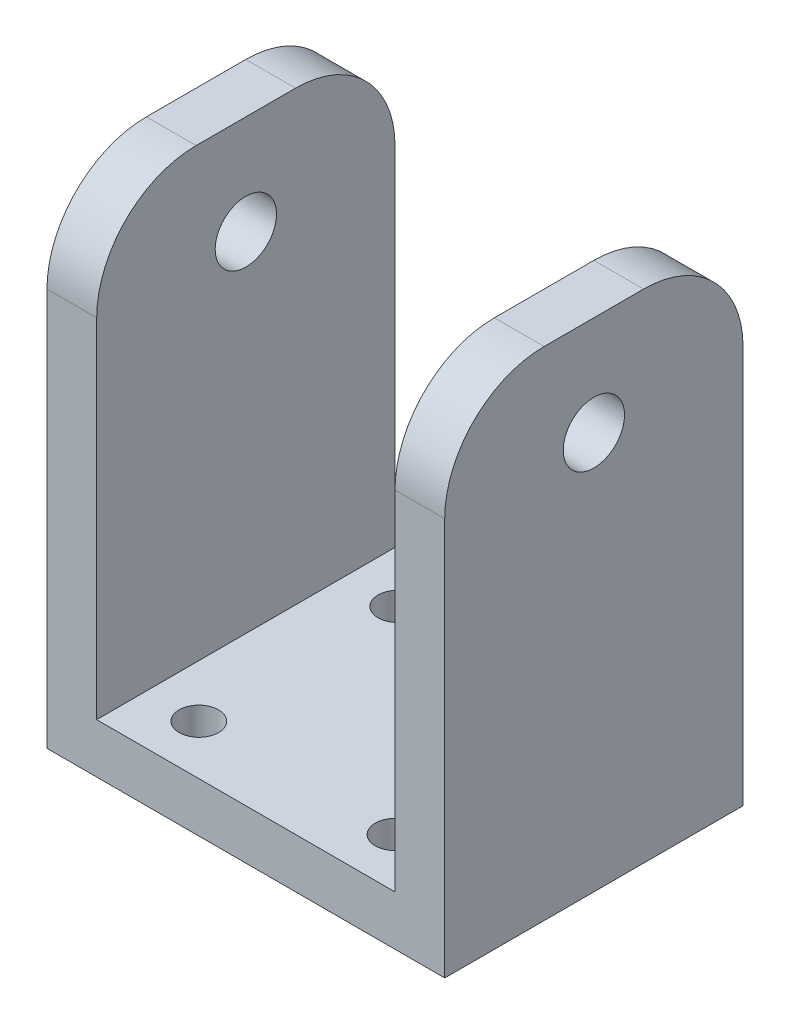
ISO-10303-21;
HEADER;
FILE_DESCRIPTION(('STEP AP214'),'2;1');
FILE_NAME('part.step','',(''),(''),'','','');
FILE_SCHEMA(('AUTOMOTIVE_DESIGN { 1 0 10303 214 1 1 1 1 }'));
ENDSEC;
DATA;
#1=APPLICATION_CONTEXT('core data for automotive mechanical design processes');
#2=APPLICATION_PROTOCOL_DEFINITION('international standard','automotive_design',2000,#1);
#3=PRODUCT_CONTEXT('',#1,'mechanical');
#4=PRODUCT('Part','Part','',(#3));
#5=PRODUCT_RELATED_PRODUCT_CATEGORY('part','',(#4));
#6=PRODUCT_DEFINITION_FORMATION('','',#4);
#7=PRODUCT_DEFINITION_CONTEXT('part definition',#1,'design');
#8=PRODUCT_DEFINITION('design','',#6,#7);
#9=PRODUCT_DEFINITION_SHAPE('','',#8);
#10=(LENGTH_UNIT() NAMED_UNIT(*) SI_UNIT(.MILLI.,.METRE.));
#11=(NAMED_UNIT(*) PLANE_ANGLE_UNIT() SI_UNIT($,.RADIAN.));
#12=(NAMED_UNIT(*) SI_UNIT($,.STERADIAN.) SOLID_ANGLE_UNIT());
#13=UNCERTAINTY_MEASURE_WITH_UNIT(LENGTH_MEASURE(1.E-05),#10,'distance_accuracy_value','');
#14=(GEOMETRIC_REPRESENTATION_CONTEXT(3) GLOBAL_UNCERTAINTY_ASSIGNED_CONTEXT((#13)) GLOBAL_UNIT_ASSIGNED_CONTEXT((#10,
#11,#12)) REPRESENTATION_CONTEXT('',''));
#15=CARTESIAN_POINT('',(0.,0.,0.));
#16=DIRECTION('',(0.,0.,1.));
#17=DIRECTION('',(1.,0.,0.));
#18=AXIS2_PLACEMENT_3D('',#15,#16,#17);
#19=CARTESIAN_POINT('',(0.,50.,0.));
#20=DIRECTION('',(0.,-1.,0.));
#21=DIRECTION('',(0.,0.,-1.));
#22=AXIS2_PLACEMENT_3D('',#19,#20,#21);
#23=PLANE('',#22);
#24=DIRECTION('',(0.,0.,1.));
#25=VECTOR('',#24,1.);
#26=CARTESIAN_POINT('',(5.,50.,-30.));
#27=LINE('',#26,#25);
#28=CARTESIAN_POINT('',(5.,50.,-20.));
#29=VERTEX_POINT('',#28);
#30=CARTESIAN_POINT('',(5.,50.,-10.));
#31=VERTEX_POINT('',#30);
#32=EDGE_CURVE('E159',#29,#31,#27,.T.);
#33=ORIENTED_EDGE('',*,*,#32,.F.);
#34=DIRECTION('',(-1.,0.,0.));
#35=VECTOR('',#34,1.);
#36=CARTESIAN_POINT('',(0.,50.,-20.));
#37=LINE('',#36,#35);
#38=CARTESIAN_POINT('',(0.,50.,-20.));
#39=VERTEX_POINT('',#38);
#40=EDGE_CURVE('E195',#29,#39,#37,.T.);
#41=ORIENTED_EDGE('',*,*,#40,.T.);
#42=DIRECTION('',(0.,0.,1.));
#43=VECTOR('',#42,1.);
#44=CARTESIAN_POINT('',(0.,50.,0.));
#45=LINE('',#44,#43);
#46=CARTESIAN_POINT('',(0.,50.,-10.));
#47=VERTEX_POINT('',#46);
#48=EDGE_CURVE('E167',#39,#47,#45,.T.);
#49=ORIENTED_EDGE('',*,*,#48,.T.);
#50=DIRECTION('',(1.,0.,0.));
#51=VECTOR('',#50,1.);
#52=CARTESIAN_POINT('',(0.,50.,-10.));
#53=LINE('',#52,#51);
#54=EDGE_CURVE('E192',#47,#31,#53,.T.);
#55=ORIENTED_EDGE('',*,*,#54,.T.);
#56=EDGE_LOOP('',(#33,#41,#49,#55));
#57=FACE_BOUND('',#56,.T.);
#58=ADVANCED_FACE('F35',(#57),#23,.F.);
#59=CARTESIAN_POINT('',(0.,50.,0.));
#60=DIRECTION('',(1.,0.,0.));
#61=DIRECTION('',(0.,0.,-1.));
#62=AXIS2_PLACEMENT_3D('',#59,#60,#61);
#63=PLANE('',#62);
#64=CARTESIAN_POINT('',(0.,40.,-15.));
#65=DIRECTION('',(1.,0.,0.));
#66=DIRECTION('',(0.,0.,-1.));
#67=AXIS2_PLACEMENT_3D('',#64,#65,#66);
#68=CIRCLE('',#67,3.08310492579836);
#69=CARTESIAN_POINT('',(0.,40.,-18.0831049257984));
#70=VERTEX_POINT('',#69);
#71=EDGE_CURVE('E309',#70,#70,#68,.T.);
#72=ORIENTED_EDGE('',*,*,#71,.T.);
#73=EDGE_LOOP('',(#72));
#74=FACE_BOUND('',#73,.T.);
#75=ORIENTED_EDGE('',*,*,#48,.F.);
#76=CARTESIAN_POINT('',(0.,40.,-20.));
#77=DIRECTION('',(1.,0.,0.));
#78=DIRECTION('',(0.,0.,-1.));
#79=AXIS2_PLACEMENT_3D('',#76,#77,#78);
#80=CIRCLE('',#79,10.);
#81=CARTESIAN_POINT('',(0.,40.,-30.));
#82=VERTEX_POINT('',#81);
#83=EDGE_CURVE('E200',#39,#82,#80,.F.);
#84=ORIENTED_EDGE('',*,*,#83,.T.);
#85=DIRECTION('',(0.,-1.,0.));
#86=VECTOR('',#85,1.);
#87=CARTESIAN_POINT('',(0.,50.,-30.));
#88=LINE('',#87,#86);
#89=CARTESIAN_POINT('',(0.,0.,-30.));
#90=VERTEX_POINT('',#89);
#91=EDGE_CURVE('E174',#82,#90,#88,.T.);
#92=ORIENTED_EDGE('',*,*,#91,.T.);
#93=DIRECTION('',(0.,0.,1.));
#94=VECTOR('',#93,1.);
#95=CARTESIAN_POINT('',(0.,0.,0.));
#96=LINE('',#95,#94);
#97=CARTESIAN_POINT('',(0.,0.,0.));
#98=VERTEX_POINT('',#97);
#99=EDGE_CURVE('E162',#90,#98,#96,.T.);
#100=ORIENTED_EDGE('',*,*,#99,.T.);
#101=DIRECTION('',(0.,-1.,0.));
#102=VECTOR('',#101,1.);
#103=CARTESIAN_POINT('',(0.,50.,0.));
#104=LINE('',#103,#102);
#105=CARTESIAN_POINT('',(0.,40.,0.));
#106=VERTEX_POINT('',#105);
#107=EDGE_CURVE('E190',#106,#98,#104,.T.);
#108=ORIENTED_EDGE('',*,*,#107,.F.);
#109=CARTESIAN_POINT('',(0.,40.,-10.));
#110=DIRECTION('',(1.,0.,0.));
#111=DIRECTION('',(0.,0.,-1.));
#112=AXIS2_PLACEMENT_3D('',#109,#110,#111);
#113=CIRCLE('',#112,10.);
#114=EDGE_CURVE('E198',#106,#47,#113,.F.);
#115=ORIENTED_EDGE('',*,*,#114,.T.);
#116=EDGE_LOOP('',(#75,#84,#92,#100,#108,#115));
#117=FACE_BOUND('',#116,.T.);
#118=ADVANCED_FACE('F230',(#74,#117),#63,.F.);
#119=CARTESIAN_POINT('',(0.,50.,0.));
#120=DIRECTION('',(0.,0.,-1.));
#121=DIRECTION('',(-1.,0.,0.));
#122=AXIS2_PLACEMENT_3D('',#119,#120,#121);
#123=PLANE('',#122);
#124=DIRECTION('',(0.,-1.,0.));
#125=VECTOR('',#124,1.);
#126=CARTESIAN_POINT('',(40.,50.,0.));
#127=LINE('',#126,#125);
#128=CARTESIAN_POINT('',(40.,40.,0.));
#129=VERTEX_POINT('',#128);
#130=CARTESIAN_POINT('',(40.,0.,0.));
#131=VERTEX_POINT('',#130);
#132=EDGE_CURVE('E188',#129,#131,#127,.T.);
#133=ORIENTED_EDGE('',*,*,#132,.F.);
#134=DIRECTION('',(1.,0.,0.));
#135=VECTOR('',#134,1.);
#136=CARTESIAN_POINT('',(0.,40.,0.));
#137=LINE('',#136,#135);
#138=CARTESIAN_POINT('',(35.,40.,0.));
#139=VERTEX_POINT('',#138);
#140=EDGE_CURVE('E11',#129,#139,#137,.F.);
#141=ORIENTED_EDGE('',*,*,#140,.T.);
#142=DIRECTION('',(0.,1.,0.));
#143=VECTOR('',#142,1.);
#144=CARTESIAN_POINT('',(35.,50.,0.));
#145=LINE('',#144,#143);
#146=CARTESIAN_POINT('',(35.,5.,0.));
#147=VERTEX_POINT('',#146);
#148=EDGE_CURVE('E135',#147,#139,#145,.T.);
#149=ORIENTED_EDGE('',*,*,#148,.F.);
#150=DIRECTION('',(1.,0.,0.));
#151=VECTOR('',#150,1.);
#152=CARTESIAN_POINT('',(5.,5.,0.));
#153=LINE('',#152,#151);
#154=CARTESIAN_POINT('',(5.,5.,0.));
#155=VERTEX_POINT('',#154);
#156=EDGE_CURVE('E155',#155,#147,#153,.T.);
#157=ORIENTED_EDGE('',*,*,#156,.F.);
#158=DIRECTION('',(0.,-1.,0.));
#159=VECTOR('',#158,1.);
#160=CARTESIAN_POINT('',(5.,50.,0.));
#161=LINE('',#160,#159);
#162=CARTESIAN_POINT('',(5.,40.,0.));
#163=VERTEX_POINT('',#162);
#164=EDGE_CURVE('E141',#163,#155,#161,.T.);
#165=ORIENTED_EDGE('',*,*,#164,.F.);
#166=DIRECTION('',(1.,0.,0.));
#167=VECTOR('',#166,1.);
#168=CARTESIAN_POINT('',(0.,40.,0.));
#169=LINE('',#168,#167);
#170=EDGE_CURVE('E44',#163,#106,#169,.F.);
#171=ORIENTED_EDGE('',*,*,#170,.T.);
#172=ORIENTED_EDGE('',*,*,#107,.T.);
#173=DIRECTION('',(1.,0.,0.));
#174=VECTOR('',#173,1.);
#175=CARTESIAN_POINT('',(0.,0.,0.));
#176=LINE('',#175,#174);
#177=EDGE_CURVE('E177',#98,#131,#176,.T.);
#178=ORIENTED_EDGE('',*,*,#177,.T.);
#179=EDGE_LOOP('',(#133,#141,#149,#157,#165,#171,#172,#178));
#180=FACE_BOUND('',#179,.T.);
#181=ADVANCED_FACE('F224',(#180),#123,.F.);
#182=CARTESIAN_POINT('',(40.,50.,0.));
#183=DIRECTION('',(-1.,0.,0.));
#184=DIRECTION('',(0.,0.,1.));
#185=AXIS2_PLACEMENT_3D('',#182,#183,#184);
#186=PLANE('',#185);
#187=CARTESIAN_POINT('',(40.,40.,-15.));
#188=DIRECTION('',(1.,0.,0.));
#189=DIRECTION('',(0.,0.,-1.));
#190=AXIS2_PLACEMENT_3D('',#187,#188,#189);
#191=CIRCLE('',#190,3.08310492579836);
#192=CARTESIAN_POINT('',(40.,40.,-18.0831049257984));
#193=VERTEX_POINT('',#192);
#194=EDGE_CURVE('E315',#193,#193,#191,.T.);
#195=ORIENTED_EDGE('',*,*,#194,.F.);
#196=EDGE_LOOP('',(#195));
#197=FACE_BOUND('',#196,.T.);
#198=DIRECTION('',(0.,-1.,0.));
#199=VECTOR('',#198,1.);
#200=CARTESIAN_POINT('',(40.,50.,-30.));
#201=LINE('',#200,#199);
#202=CARTESIAN_POINT('',(40.,40.,-30.));
#203=VERTEX_POINT('',#202);
#204=CARTESIAN_POINT('',(40.,0.,-30.));
#205=VERTEX_POINT('',#204);
#206=EDGE_CURVE('E186',#203,#205,#201,.T.);
#207=ORIENTED_EDGE('',*,*,#206,.F.);
#208=CARTESIAN_POINT('',(40.,40.,-20.));
#209=DIRECTION('',(-1.,0.,0.));
#210=DIRECTION('',(0.,0.,1.));
#211=AXIS2_PLACEMENT_3D('',#208,#209,#210);
#212=CIRCLE('',#211,10.);
#213=CARTESIAN_POINT('',(40.,50.,-20.));
#214=VERTEX_POINT('',#213);
#215=EDGE_CURVE('E220',#203,#214,#212,.F.);
#216=ORIENTED_EDGE('',*,*,#215,.T.);
#217=DIRECTION('',(0.,0.,-1.));
#218=VECTOR('',#217,1.);
#219=CARTESIAN_POINT('',(40.,50.,0.));
#220=LINE('',#219,#218);
#221=CARTESIAN_POINT('',(40.,50.,-10.));
#222=VERTEX_POINT('',#221);
#223=EDGE_CURVE('E170',#222,#214,#220,.T.);
#224=ORIENTED_EDGE('',*,*,#223,.F.);
#225=CARTESIAN_POINT('',(40.,40.,-10.));
#226=DIRECTION('',(-1.,0.,0.));
#227=DIRECTION('',(0.,0.,1.));
#228=AXIS2_PLACEMENT_3D('',#225,#226,#227);
#229=CIRCLE('',#228,10.);
#230=EDGE_CURVE('E51',#222,#129,#229,.F.);
#231=ORIENTED_EDGE('',*,*,#230,.T.);
#232=ORIENTED_EDGE('',*,*,#132,.T.);
#233=DIRECTION('',(0.,0.,-1.));
#234=VECTOR('',#233,1.);
#235=CARTESIAN_POINT('',(40.,0.,0.));
#236=LINE('',#235,#234);
#237=EDGE_CURVE('E180',#131,#205,#236,.T.);
#238=ORIENTED_EDGE('',*,*,#237,.T.);
#239=EDGE_LOOP('',(#207,#216,#224,#231,#232,#238));
#240=FACE_BOUND('',#239,.T.);
#241=ADVANCED_FACE('F257',(#197,#240),#186,.F.);
#242=CARTESIAN_POINT('',(0.,50.,-30.));
#243=DIRECTION('',(0.,0.,1.));
#244=DIRECTION('',(1.,0.,0.));
#245=AXIS2_PLACEMENT_3D('',#242,#243,#244);
#246=PLANE('',#245);
#247=ORIENTED_EDGE('',*,*,#91,.F.);
#248=DIRECTION('',(-1.,0.,0.));
#249=VECTOR('',#248,1.);
#250=CARTESIAN_POINT('',(0.,40.,-30.));
#251=LINE('',#250,#249);
#252=CARTESIAN_POINT('',(5.,40.,-30.));
#253=VERTEX_POINT('',#252);
#254=EDGE_CURVE('E132',#82,#253,#251,.F.);
#255=ORIENTED_EDGE('',*,*,#254,.T.);
#256=DIRECTION('',(0.,-1.,0.));
#257=VECTOR('',#256,1.);
#258=CARTESIAN_POINT('',(5.,50.,-30.));
#259=LINE('',#258,#257);
#260=CARTESIAN_POINT('',(5.,5.,-30.));
#261=VERTEX_POINT('',#260);
#262=EDGE_CURVE('E124',#253,#261,#259,.T.);
#263=ORIENTED_EDGE('',*,*,#262,.T.);
#264=DIRECTION('',(1.,0.,0.));
#265=VECTOR('',#264,1.);
#266=CARTESIAN_POINT('',(5.,5.,-30.));
#267=LINE('',#266,#265);
#268=CARTESIAN_POINT('',(35.,5.,-30.));
#269=VERTEX_POINT('',#268);
#270=EDGE_CURVE('E130',#261,#269,#267,.T.);
#271=ORIENTED_EDGE('',*,*,#270,.T.);
#272=DIRECTION('',(0.,1.,0.));
#273=VECTOR('',#272,1.);
#274=CARTESIAN_POINT('',(35.,50.,-30.));
#275=LINE('',#274,#273);
#276=CARTESIAN_POINT('',(35.,40.,-30.));
#277=VERTEX_POINT('',#276);
#278=EDGE_CURVE('E146',#269,#277,#275,.T.);
#279=ORIENTED_EDGE('',*,*,#278,.T.);
#280=DIRECTION('',(-1.,0.,0.));
#281=VECTOR('',#280,1.);
#282=CARTESIAN_POINT('',(0.,40.,-30.));
#283=LINE('',#282,#281);
#284=EDGE_CURVE('E202',#277,#203,#283,.F.);
#285=ORIENTED_EDGE('',*,*,#284,.T.);
#286=ORIENTED_EDGE('',*,*,#206,.T.);
#287=DIRECTION('',(-1.,0.,0.));
#288=VECTOR('',#287,1.);
#289=CARTESIAN_POINT('',(0.,0.,-30.));
#290=LINE('',#289,#288);
#291=EDGE_CURVE('E171',#205,#90,#290,.T.);
#292=ORIENTED_EDGE('',*,*,#291,.T.);
#293=EDGE_LOOP('',(#247,#255,#263,#271,#279,#285,#286,#292));
#294=FACE_BOUND('',#293,.T.);
#295=ADVANCED_FACE('F127',(#294),#246,.F.);
#296=ORIENTED_EDGE('',*,*,#223,.T.);
#297=DIRECTION('',(-1.,0.,0.));
#298=VECTOR('',#297,1.);
#299=CARTESIAN_POINT('',(0.,50.,-20.));
#300=LINE('',#299,#298);
#301=CARTESIAN_POINT('',(35.,50.,-20.));
#302=VERTEX_POINT('',#301);
#303=EDGE_CURVE('E212',#214,#302,#300,.T.);
#304=ORIENTED_EDGE('',*,*,#303,.T.);
#305=DIRECTION('',(0.,0.,1.));
#306=VECTOR('',#305,1.);
#307=CARTESIAN_POINT('',(35.,50.,-30.));
#308=LINE('',#307,#306);
#309=CARTESIAN_POINT('',(35.,50.,-10.));
#310=VERTEX_POINT('',#309);
#311=EDGE_CURVE('E163',#302,#310,#308,.T.);
#312=ORIENTED_EDGE('',*,*,#311,.T.);
#313=DIRECTION('',(1.,0.,0.));
#314=VECTOR('',#313,1.);
#315=CARTESIAN_POINT('',(0.,50.,-10.));
#316=LINE('',#315,#314);
#317=EDGE_CURVE('E209',#310,#222,#316,.T.);
#318=ORIENTED_EDGE('',*,*,#317,.T.);
#319=EDGE_LOOP('',(#296,#304,#312,#318));
#320=FACE_BOUND('',#319,.T.);
#321=ADVANCED_FACE('F251',(#320),#23,.F.);
#322=CARTESIAN_POINT('',(0.,0.,0.));
#323=DIRECTION('',(0.,-1.,0.));
#324=DIRECTION('',(0.,0.,-1.));
#325=AXIS2_PLACEMENT_3D('',#322,#323,#324);
#326=PLANE('',#325);
#327=CARTESIAN_POINT('',(30.,0.,-5.));
#328=DIRECTION('',(0.,-1.,0.));
#329=DIRECTION('',(0.,0.,-1.));
#330=AXIS2_PLACEMENT_3D('',#327,#328,#329);
#331=CIRCLE('',#330,1.98437499999999);
#332=CARTESIAN_POINT('',(30.,0.,-6.98437499999999));
#333=VERTEX_POINT('',#332);
#334=EDGE_CURVE('E289',#333,#333,#331,.T.);
#335=ORIENTED_EDGE('',*,*,#334,.F.);
#336=EDGE_LOOP('',(#335));
#337=FACE_BOUND('',#336,.T.);
#338=CARTESIAN_POINT('',(30.,0.,-25.));
#339=DIRECTION('',(0.,-1.,0.));
#340=DIRECTION('',(0.,0.,-1.));
#341=AXIS2_PLACEMENT_3D('',#338,#339,#340);
#342=CIRCLE('',#341,1.98437499999999);
#343=CARTESIAN_POINT('',(30.,0.,-26.984375));
#344=VERTEX_POINT('',#343);
#345=EDGE_CURVE('E293',#344,#344,#342,.T.);
#346=ORIENTED_EDGE('',*,*,#345,.F.);
#347=EDGE_LOOP('',(#346));
#348=FACE_BOUND('',#347,.T.);
#349=CARTESIAN_POINT('',(10.2728037976814,0.,-25.));
#350=DIRECTION('',(0.,-1.,0.));
#351=DIRECTION('',(0.,0.,-1.));
#352=AXIS2_PLACEMENT_3D('',#349,#350,#351);
#353=CIRCLE('',#352,1.984375);
#354=CARTESIAN_POINT('',(10.2728037976814,0.,-26.984375));
#355=VERTEX_POINT('',#354);
#356=EDGE_CURVE('E297',#355,#355,#353,.T.);
#357=ORIENTED_EDGE('',*,*,#356,.F.);
#358=EDGE_LOOP('',(#357));
#359=FACE_BOUND('',#358,.T.);
#360=CARTESIAN_POINT('',(10.2728037976814,0.,-5.));
#361=DIRECTION('',(0.,-1.,0.));
#362=DIRECTION('',(0.,0.,-1.));
#363=AXIS2_PLACEMENT_3D('',#360,#361,#362);
#364=CIRCLE('',#363,1.984375);
#365=CARTESIAN_POINT('',(10.2728037976814,0.,-6.984375));
#366=VERTEX_POINT('',#365);
#367=EDGE_CURVE('E156',#366,#366,#364,.T.);
#368=ORIENTED_EDGE('',*,*,#367,.F.);
#369=EDGE_LOOP('',(#368));
#370=FACE_BOUND('',#369,.T.);
#371=ORIENTED_EDGE('',*,*,#99,.F.);
#372=ORIENTED_EDGE('',*,*,#291,.F.);
#373=ORIENTED_EDGE('',*,*,#237,.F.);
#374=ORIENTED_EDGE('',*,*,#177,.F.);
#375=EDGE_LOOP('',(#371,#372,#373,#374));
#376=FACE_BOUND('',#375,.T.);
#377=ADVANCED_FACE('F242',(#337,#348,#359,#370,#376),#326,.T.);
#378=CARTESIAN_POINT('',(5.,50.,-30.));
#379=DIRECTION('',(-1.,0.,0.));
#380=DIRECTION('',(0.,-1.,0.));
#381=AXIS2_PLACEMENT_3D('',#378,#379,#380);
#382=PLANE('',#381);
#383=CARTESIAN_POINT('',(5.,40.,-15.));
#384=DIRECTION('',(-1.,0.,0.));
#385=DIRECTION('',(0.,-1.,0.));
#386=AXIS2_PLACEMENT_3D('',#383,#384,#385);
#387=CIRCLE('',#386,3.08310492579836);
#388=CARTESIAN_POINT('',(5.,36.9168950742016,-15.));
#389=VERTEX_POINT('',#388);
#390=EDGE_CURVE('E312',#389,#389,#387,.T.);
#391=ORIENTED_EDGE('',*,*,#390,.T.);
#392=EDGE_LOOP('',(#391));
#393=FACE_BOUND('',#392,.T.);
#394=ORIENTED_EDGE('',*,*,#262,.F.);
#395=CARTESIAN_POINT('',(5.,40.,-20.));
#396=DIRECTION('',(-1.,0.,0.));
#397=DIRECTION('',(0.,-1.,0.));
#398=AXIS2_PLACEMENT_3D('',#395,#396,#397);
#399=CIRCLE('',#398,10.);
#400=EDGE_CURVE('E207',#253,#29,#399,.F.);
#401=ORIENTED_EDGE('',*,*,#400,.T.);
#402=ORIENTED_EDGE('',*,*,#32,.T.);
#403=CARTESIAN_POINT('',(5.,40.,-10.));
#404=DIRECTION('',(-1.,0.,0.));
#405=DIRECTION('',(0.,-1.,0.));
#406=AXIS2_PLACEMENT_3D('',#403,#404,#405);
#407=CIRCLE('',#406,10.);
#408=EDGE_CURVE('E205',#31,#163,#407,.F.);
#409=ORIENTED_EDGE('',*,*,#408,.T.);
#410=ORIENTED_EDGE('',*,*,#164,.T.);
#411=DIRECTION('',(0.,0.,1.));
#412=VECTOR('',#411,1.);
#413=CARTESIAN_POINT('',(5.,5.,-30.));
#414=LINE('',#413,#412);
#415=EDGE_CURVE('E138',#261,#155,#414,.T.);
#416=ORIENTED_EDGE('',*,*,#415,.F.);
#417=EDGE_LOOP('',(#394,#401,#402,#409,#410,#416));
#418=FACE_BOUND('',#417,.T.);
#419=ADVANCED_FACE('F139',(#393,#418),#382,.F.);
#420=CARTESIAN_POINT('',(35.,50.,-30.));
#421=DIRECTION('',(1.,0.,0.));
#422=DIRECTION('',(0.,1.,0.));
#423=AXIS2_PLACEMENT_3D('',#420,#421,#422);
#424=PLANE('',#423);
#425=CARTESIAN_POINT('',(35.,40.,-15.));
#426=DIRECTION('',(1.,0.,0.));
#427=DIRECTION('',(0.,1.,0.));
#428=AXIS2_PLACEMENT_3D('',#425,#426,#427);
#429=CIRCLE('',#428,3.08310492579836);
#430=CARTESIAN_POINT('',(35.,43.0831049257984,-15.));
#431=VERTEX_POINT('',#430);
#432=EDGE_CURVE('E39',#431,#431,#429,.T.);
#433=ORIENTED_EDGE('',*,*,#432,.T.);
#434=EDGE_LOOP('',(#433));
#435=FACE_BOUND('',#434,.T.);
#436=ORIENTED_EDGE('',*,*,#311,.F.);
#437=CARTESIAN_POINT('',(35.,40.,-20.));
#438=DIRECTION('',(1.,0.,0.));
#439=DIRECTION('',(0.,1.,0.));
#440=AXIS2_PLACEMENT_3D('',#437,#438,#439);
#441=CIRCLE('',#440,10.);
#442=EDGE_CURVE('E217',#302,#277,#441,.F.);
#443=ORIENTED_EDGE('',*,*,#442,.T.);
#444=ORIENTED_EDGE('',*,*,#278,.F.);
#445=DIRECTION('',(0.,0.,1.));
#446=VECTOR('',#445,1.);
#447=CARTESIAN_POINT('',(35.,5.,-30.));
#448=LINE('',#447,#446);
#449=EDGE_CURVE('E145',#269,#147,#448,.T.);
#450=ORIENTED_EDGE('',*,*,#449,.T.);
#451=ORIENTED_EDGE('',*,*,#148,.T.);
#452=CARTESIAN_POINT('',(35.,40.,-10.));
#453=DIRECTION('',(1.,0.,0.));
#454=DIRECTION('',(0.,1.,0.));
#455=AXIS2_PLACEMENT_3D('',#452,#453,#454);
#456=CIRCLE('',#455,10.);
#457=EDGE_CURVE('E215',#139,#310,#456,.F.);
#458=ORIENTED_EDGE('',*,*,#457,.T.);
#459=EDGE_LOOP('',(#436,#443,#444,#450,#451,#458));
#460=FACE_BOUND('',#459,.T.);
#461=ADVANCED_FACE('F249',(#435,#460),#424,.F.);
#462=CARTESIAN_POINT('',(5.,5.,-30.));
#463=DIRECTION('',(0.,-1.,0.));
#464=DIRECTION('',(1.,0.,0.));
#465=AXIS2_PLACEMENT_3D('',#462,#463,#464);
#466=PLANE('',#465);
#467=CARTESIAN_POINT('',(30.,5.,-5.));
#468=DIRECTION('',(0.,1.,0.));
#469=DIRECTION('',(-1.,0.,0.));
#470=AXIS2_PLACEMENT_3D('',#467,#468,#469);
#471=CIRCLE('',#470,1.98437499999999);
#472=CARTESIAN_POINT('',(28.015625,5.,-5.));
#473=VERTEX_POINT('',#472);
#474=EDGE_CURVE('E323',#473,#473,#471,.T.);
#475=ORIENTED_EDGE('',*,*,#474,.F.);
#476=EDGE_LOOP('',(#475));
#477=FACE_BOUND('',#476,.T.);
#478=CARTESIAN_POINT('',(30.,5.,-25.));
#479=DIRECTION('',(0.,1.,0.));
#480=DIRECTION('',(-1.,0.,0.));
#481=AXIS2_PLACEMENT_3D('',#478,#479,#480);
#482=CIRCLE('',#481,1.98437499999999);
#483=CARTESIAN_POINT('',(28.015625,5.,-25.));
#484=VERTEX_POINT('',#483);
#485=EDGE_CURVE('E319',#484,#484,#482,.T.);
#486=ORIENTED_EDGE('',*,*,#485,.F.);
#487=EDGE_LOOP('',(#486));
#488=FACE_BOUND('',#487,.T.);
#489=CARTESIAN_POINT('',(10.2728037976814,5.,-25.));
#490=DIRECTION('',(0.,1.,0.));
#491=DIRECTION('',(0.,0.,1.));
#492=AXIS2_PLACEMENT_3D('',#489,#490,#491);
#493=CIRCLE('',#492,1.984375);
#494=CARTESIAN_POINT('',(10.2728037976814,5.,-23.015625));
#495=VERTEX_POINT('',#494);
#496=EDGE_CURVE('E306',#495,#495,#493,.T.);
#497=ORIENTED_EDGE('',*,*,#496,.F.);
#498=EDGE_LOOP('',(#497));
#499=FACE_BOUND('',#498,.T.);
#500=CARTESIAN_POINT('',(10.2728037976814,5.,-5.));
#501=DIRECTION('',(0.,1.,0.));
#502=DIRECTION('',(0.,0.,1.));
#503=AXIS2_PLACEMENT_3D('',#500,#501,#502);
#504=CIRCLE('',#503,1.984375);
#505=CARTESIAN_POINT('',(10.2728037976814,5.,-3.015625));
#506=VERTEX_POINT('',#505);
#507=EDGE_CURVE('E301',#506,#506,#504,.T.);
#508=ORIENTED_EDGE('',*,*,#507,.F.);
#509=EDGE_LOOP('',(#508));
#510=FACE_BOUND('',#509,.T.);
#511=ORIENTED_EDGE('',*,*,#156,.T.);
#512=ORIENTED_EDGE('',*,*,#449,.F.);
#513=ORIENTED_EDGE('',*,*,#270,.F.);
#514=ORIENTED_EDGE('',*,*,#415,.T.);
#515=EDGE_LOOP('',(#511,#512,#513,#514));
#516=FACE_BOUND('',#515,.T.);
#517=ADVANCED_FACE('F148',(#477,#488,#499,#510,#516),#466,.F.);
#518=CARTESIAN_POINT('',(0.,40.,-20.));
#519=DIRECTION('',(-1.,0.,0.));
#520=DIRECTION('',(0.,0.,1.));
#521=AXIS2_PLACEMENT_3D('',#518,#519,#520);
#522=CYLINDRICAL_SURFACE('',#521,10.);
#523=ORIENTED_EDGE('',*,*,#400,.F.);
#524=ORIENTED_EDGE('',*,*,#254,.F.);
#525=ORIENTED_EDGE('',*,*,#83,.F.);
#526=ORIENTED_EDGE('',*,*,#40,.F.);
#527=EDGE_LOOP('',(#523,#524,#525,#526));
#528=FACE_BOUND('',#527,.T.);
#529=ADVANCED_FACE('F237',(#528),#522,.T.);
#530=CARTESIAN_POINT('',(0.,40.,-20.));
#531=DIRECTION('',(-1.,0.,0.));
#532=DIRECTION('',(0.,0.,1.));
#533=AXIS2_PLACEMENT_3D('',#530,#531,#532);
#534=CYLINDRICAL_SURFACE('',#533,10.);
#535=ORIENTED_EDGE('',*,*,#215,.F.);
#536=ORIENTED_EDGE('',*,*,#284,.F.);
#537=ORIENTED_EDGE('',*,*,#442,.F.);
#538=ORIENTED_EDGE('',*,*,#303,.F.);
#539=EDGE_LOOP('',(#535,#536,#537,#538));
#540=FACE_BOUND('',#539,.T.);
#541=ADVANCED_FACE('F255',(#540),#534,.T.);
#542=CARTESIAN_POINT('',(0.,40.,-10.));
#543=DIRECTION('',(1.,0.,0.));
#544=DIRECTION('',(0.,0.,-1.));
#545=AXIS2_PLACEMENT_3D('',#542,#543,#544);
#546=CYLINDRICAL_SURFACE('',#545,10.);
#547=ORIENTED_EDGE('',*,*,#457,.F.);
#548=ORIENTED_EDGE('',*,*,#140,.F.);
#549=ORIENTED_EDGE('',*,*,#230,.F.);
#550=ORIENTED_EDGE('',*,*,#317,.F.);
#551=EDGE_LOOP('',(#547,#548,#549,#550));
#552=FACE_BOUND('',#551,.T.);
#553=ADVANCED_FACE('F245',(#552),#546,.T.);
#554=CARTESIAN_POINT('',(0.,40.,-10.));
#555=DIRECTION('',(1.,0.,0.));
#556=DIRECTION('',(0.,0.,-1.));
#557=AXIS2_PLACEMENT_3D('',#554,#555,#556);
#558=CYLINDRICAL_SURFACE('',#557,10.);
#559=ORIENTED_EDGE('',*,*,#114,.F.);
#560=ORIENTED_EDGE('',*,*,#170,.F.);
#561=ORIENTED_EDGE('',*,*,#408,.F.);
#562=ORIENTED_EDGE('',*,*,#54,.F.);
#563=EDGE_LOOP('',(#559,#560,#561,#562));
#564=FACE_BOUND('',#563,.T.);
#565=ADVANCED_FACE('F37',(#564),#558,.T.);
#566=CARTESIAN_POINT('',(10.2728037976814,-25.,-5.));
#567=DIRECTION('',(0.,1.,0.));
#568=DIRECTION('',(0.,0.,1.));
#569=AXIS2_PLACEMENT_3D('',#566,#567,#568);
#570=CYLINDRICAL_SURFACE('',#569,1.984375);
#571=ORIENTED_EDGE('',*,*,#367,.T.);
#572=EDGE_LOOP('',(#571));
#573=FACE_BOUND('',#572,.T.);
#574=ORIENTED_EDGE('',*,*,#507,.T.);
#575=EDGE_LOOP('',(#574));
#576=FACE_BOUND('',#575,.T.);
#577=ADVANCED_FACE('F338',(#573,#576),#570,.F.);
#578=CARTESIAN_POINT('',(10.2728037976814,-25.,-25.));
#579=DIRECTION('',(0.,1.,0.));
#580=DIRECTION('',(0.,0.,1.));
#581=AXIS2_PLACEMENT_3D('',#578,#579,#580);
#582=CYLINDRICAL_SURFACE('',#581,1.984375);
#583=ORIENTED_EDGE('',*,*,#356,.T.);
#584=EDGE_LOOP('',(#583));
#585=FACE_BOUND('',#584,.T.);
#586=ORIENTED_EDGE('',*,*,#496,.T.);
#587=EDGE_LOOP('',(#586));
#588=FACE_BOUND('',#587,.T.);
#589=ADVANCED_FACE('F340',(#585,#588),#582,.F.);
#590=CARTESIAN_POINT('',(-15.,40.,-15.));
#591=DIRECTION('',(1.,0.,0.));
#592=DIRECTION('',(0.,0.,-1.));
#593=AXIS2_PLACEMENT_3D('',#590,#591,#592);
#594=CYLINDRICAL_SURFACE('',#593,3.08310492579836);
#595=ORIENTED_EDGE('',*,*,#194,.T.);
#596=EDGE_LOOP('',(#595));
#597=FACE_BOUND('',#596,.T.);
#598=ORIENTED_EDGE('',*,*,#432,.F.);
#599=EDGE_LOOP('',(#598));
#600=FACE_BOUND('',#599,.T.);
#601=ADVANCED_FACE('F346',(#597,#600),#594,.F.);
#602=ORIENTED_EDGE('',*,*,#390,.F.);
#603=EDGE_LOOP('',(#602));
#604=FACE_BOUND('',#603,.T.);
#605=ORIENTED_EDGE('',*,*,#71,.F.);
#606=EDGE_LOOP('',(#605));
#607=FACE_BOUND('',#606,.T.);
#608=ADVANCED_FACE('F359',(#604,#607),#594,.F.);
#609=CARTESIAN_POINT('',(30.,-25.,-25.));
#610=DIRECTION('',(0.,1.,0.));
#611=DIRECTION('',(-1.,0.,0.));
#612=AXIS2_PLACEMENT_3D('',#609,#610,#611);
#613=CYLINDRICAL_SURFACE('',#612,1.98437499999999);
#614=ORIENTED_EDGE('',*,*,#345,.T.);
#615=EDGE_LOOP('',(#614));
#616=FACE_BOUND('',#615,.T.);
#617=ORIENTED_EDGE('',*,*,#485,.T.);
#618=EDGE_LOOP('',(#617));
#619=FACE_BOUND('',#618,.T.);
#620=ADVANCED_FACE('F364',(#616,#619),#613,.F.);
#621=CARTESIAN_POINT('',(30.,-25.,-5.));
#622=DIRECTION('',(0.,1.,0.));
#623=DIRECTION('',(-1.,0.,0.));
#624=AXIS2_PLACEMENT_3D('',#621,#622,#623);
#625=CYLINDRICAL_SURFACE('',#624,1.98437499999999);
#626=ORIENTED_EDGE('',*,*,#334,.T.);
#627=EDGE_LOOP('',(#626));
#628=FACE_BOUND('',#627,.T.);
#629=ORIENTED_EDGE('',*,*,#474,.T.);
#630=EDGE_LOOP('',(#629));
#631=FACE_BOUND('',#630,.T.);
#632=ADVANCED_FACE('F327',(#628,#631),#625,.F.);
#633=CLOSED_SHELL('',(#58,#118,#181,#241,#295,#321,#377,#419,#461,#517,#529,#541,#553,#565,#577,
#589,#601,#608,#620,#632));
#634=MANIFOLD_SOLID_BREP('B2',#633);
#635=ADVANCED_BREP_SHAPE_REPRESENTATION('',(#18,#634),#14);
#636=SHAPE_DEFINITION_REPRESENTATION(#9,#635);
ENDSEC;
END-ISO-10303-21;
